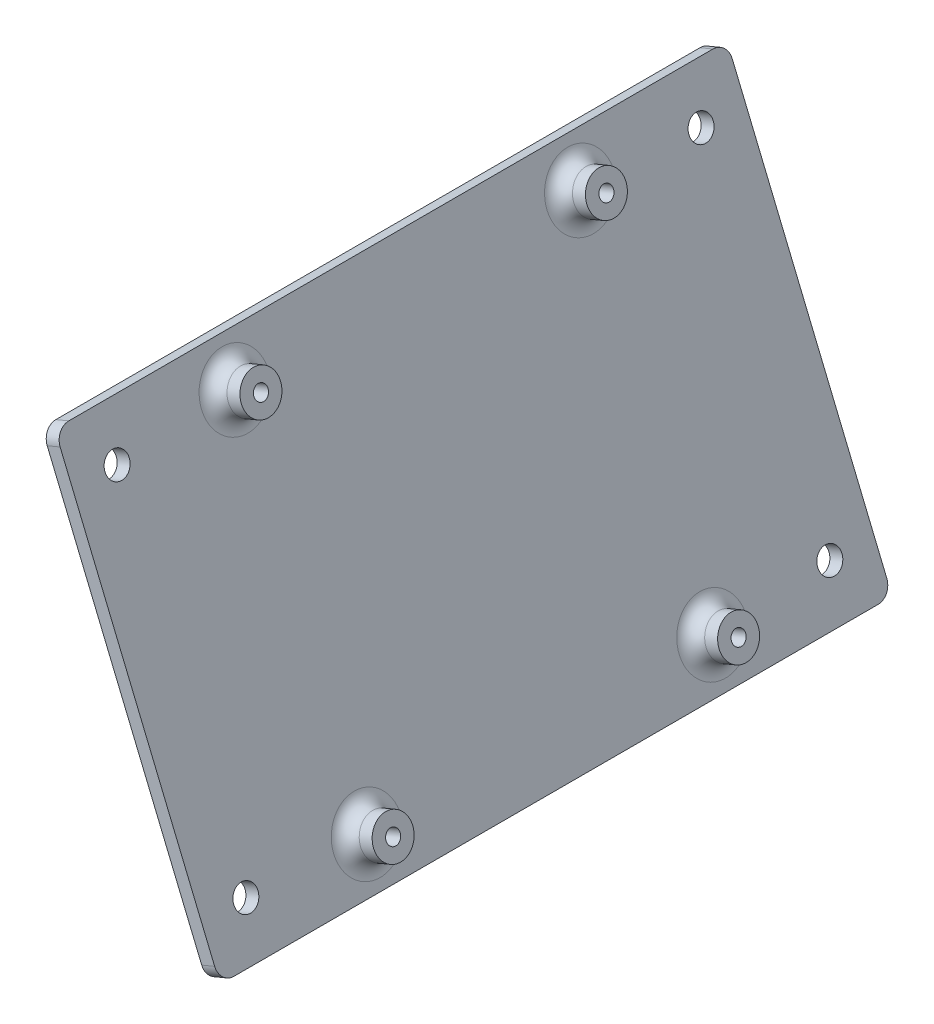
ISO-10303-21;
HEADER;
FILE_DESCRIPTION(('STEP AP214'),'2;1');
FILE_NAME('part.step','',(''),(''),'','','');
FILE_SCHEMA(('AUTOMOTIVE_DESIGN { 1 0 10303 214 1 1 1 1 }'));
ENDSEC;
DATA;
#1=APPLICATION_CONTEXT('core data for automotive mechanical design processes');
#2=APPLICATION_PROTOCOL_DEFINITION('international standard','automotive_design',2000,#1);
#3=PRODUCT_CONTEXT('',#1,'mechanical');
#4=PRODUCT('Part','Part','',(#3));
#5=PRODUCT_RELATED_PRODUCT_CATEGORY('part','',(#4));
#6=PRODUCT_DEFINITION_FORMATION('','',#4);
#7=PRODUCT_DEFINITION_CONTEXT('part definition',#1,'design');
#8=PRODUCT_DEFINITION('design','',#6,#7);
#9=PRODUCT_DEFINITION_SHAPE('','',#8);
#10=(LENGTH_UNIT() NAMED_UNIT(*) SI_UNIT(.MILLI.,.METRE.));
#11=(NAMED_UNIT(*) PLANE_ANGLE_UNIT() SI_UNIT($,.RADIAN.));
#12=(NAMED_UNIT(*) SI_UNIT($,.STERADIAN.) SOLID_ANGLE_UNIT());
#13=UNCERTAINTY_MEASURE_WITH_UNIT(LENGTH_MEASURE(1.E-05),#10,'distance_accuracy_value','');
#14=(GEOMETRIC_REPRESENTATION_CONTEXT(3) GLOBAL_UNCERTAINTY_ASSIGNED_CONTEXT((#13)) GLOBAL_UNIT_ASSIGNED_CONTEXT((#10,
#11,#12)) REPRESENTATION_CONTEXT('',''));
#15=CARTESIAN_POINT('',(0.,0.,0.));
#16=DIRECTION('',(0.,0.,1.));
#17=DIRECTION('',(1.,0.,0.));
#18=AXIS2_PLACEMENT_3D('',#15,#16,#17);
#19=CARTESIAN_POINT('',(-3730.4239511953,-1864.54989755948,-73.6875628277094));
#20=DIRECTION('',(0.,0.,1.));
#21=DIRECTION('',(1.,0.,0.));
#22=AXIS2_PLACEMENT_3D('',#19,#20,#21);
#23=PLANE('',#22);
#24=DIRECTION('',(-0.383049008063243,0.923728021347066,0.));
#25=VECTOR('',#24,1.);
#26=CARTESIAN_POINT('',(-3733.35678766308,-1865.76607816008,-73.6875628277094));
#27=LINE('',#26,#25);
#28=CARTESIAN_POINT('',(-3734.57296826368,-1862.83324169231,-73.6875628277094));
#29=VERTEX_POINT('',#28);
#30=CARTESIAN_POINT('',(-3769.59896956098,-1778.36755142033,-73.6875628277094));
#31=VERTEX_POINT('',#30);
#32=EDGE_CURVE('E140',#29,#31,#27,.T.);
#33=ORIENTED_EDGE('',*,*,#32,.T.);
#34=DIRECTION('',(-0.923728021347066,-0.383049008063243,0.));
#35=VECTOR('',#34,1.);
#36=CARTESIAN_POINT('',(-3766.6661330932,-1777.15137081973,-73.6875628277094));
#37=LINE('',#36,#35);
#38=CARTESIAN_POINT('',(-3766.6661330932,-1777.15137081973,-73.6875628277094));
#39=VERTEX_POINT('',#38);
#40=EDGE_CURVE('E117',#31,#39,#37,.F.);
#41=ORIENTED_EDGE('',*,*,#40,.T.);
#42=DIRECTION('',(-0.383049008063243,0.923728021347066,0.));
#43=VECTOR('',#42,1.);
#44=CARTESIAN_POINT('',(-3730.4239511953,-1864.54989755948,-73.6875628277094));
#45=LINE('',#44,#43);
#46=CARTESIAN_POINT('',(-3731.6401317959,-1861.6170610917,-73.6875628277094));
#47=VERTEX_POINT('',#46);
#48=EDGE_CURVE('E151',#47,#39,#45,.T.);
#49=ORIENTED_EDGE('',*,*,#48,.F.);
#50=DIRECTION('',(-0.923728021347066,-0.383049008063243,0.));
#51=VECTOR('',#50,1.);
#52=CARTESIAN_POINT('',(-3731.6401317959,-1861.6170610917,-73.6875628277094));
#53=LINE('',#52,#51);
#54=EDGE_CURVE('E122',#47,#29,#53,.T.);
#55=ORIENTED_EDGE('',*,*,#54,.T.);
#56=EDGE_LOOP('',(#33,#41,#49,#55));
#57=FACE_BOUND('',#56,.T.);
#58=ADVANCED_FACE('F41',(#57),#23,.F.);
#59=CARTESIAN_POINT('',(-3767.8823136938,-1774.21853435195,-73.6875628277094));
#60=DIRECTION('',(0.383049008063243,-0.923728021347066,0.));
#61=DIRECTION('',(0.923728021347066,0.383049008063243,0.));
#62=AXIS2_PLACEMENT_3D('',#59,#60,#61);
#63=PLANE('',#62);
#64=DIRECTION('',(0.,0.,1.));
#65=VECTOR('',#64,1.);
#66=CARTESIAN_POINT('',(-3767.8823136938,-1774.21853435195,-73.6875628277094));
#67=LINE('',#66,#65);
#68=CARTESIAN_POINT('',(-3767.8823136938,-1774.21853435195,-70.5125628277094));
#69=VERTEX_POINT('',#68);
#70=CARTESIAN_POINT('',(-3767.8823136938,-1774.21853435195,75.5374371722906));
#71=VERTEX_POINT('',#70);
#72=EDGE_CURVE('E132',#69,#71,#67,.T.);
#73=ORIENTED_EDGE('',*,*,#72,.F.);
#74=DIRECTION('',(-0.923728021347066,-0.383049008063243,0.));
#75=VECTOR('',#74,1.);
#76=CARTESIAN_POINT('',(-3767.8823136938,-1774.21853435195,-70.5125628277094));
#77=LINE('',#76,#75);
#78=CARTESIAN_POINT('',(-3770.81515016158,-1775.43471495255,-70.5125628277094));
#79=VERTEX_POINT('',#78);
#80=EDGE_CURVE('E116',#69,#79,#77,.T.);
#81=ORIENTED_EDGE('',*,*,#80,.T.);
#82=DIRECTION('',(0.,0.,1.));
#83=VECTOR('',#82,1.);
#84=CARTESIAN_POINT('',(-3770.81515016158,-1775.43471495255,-73.6875628277094));
#85=LINE('',#84,#83);
#86=CARTESIAN_POINT('',(-3770.81515016158,-1775.43471495255,75.5374371722906));
#87=VERTEX_POINT('',#86);
#88=EDGE_CURVE('E129',#79,#87,#85,.T.);
#89=ORIENTED_EDGE('',*,*,#88,.T.);
#90=DIRECTION('',(-0.923728021347066,-0.383049008063243,0.));
#91=VECTOR('',#90,1.);
#92=CARTESIAN_POINT('',(-3767.8823136938,-1774.21853435195,75.5374371722906));
#93=LINE('',#92,#91);
#94=EDGE_CURVE('E134',#87,#71,#93,.F.);
#95=ORIENTED_EDGE('',*,*,#94,.T.);
#96=EDGE_LOOP('',(#73,#81,#89,#95));
#97=FACE_BOUND('',#96,.T.);
#98=ADVANCED_FACE('F128',(#97),#63,.F.);
#99=CARTESIAN_POINT('',(-3730.4239511953,-1864.54989755948,78.7124371722906));
#100=DIRECTION('',(0.,0.,-1.));
#101=DIRECTION('',(-1.,0.,0.));
#102=AXIS2_PLACEMENT_3D('',#99,#100,#101);
#103=PLANE('',#102);
#104=DIRECTION('',(0.383049008063243,-0.923728021347066,0.));
#105=VECTOR('',#104,1.);
#106=CARTESIAN_POINT('',(-3730.4239511953,-1864.54989755948,78.7124371722906));
#107=LINE('',#106,#105);
#108=CARTESIAN_POINT('',(-3766.6661330932,-1777.15137081973,78.7124371722906));
#109=VERTEX_POINT('',#108);
#110=CARTESIAN_POINT('',(-3731.6401317959,-1861.6170610917,78.7124371722906));
#111=VERTEX_POINT('',#110);
#112=EDGE_CURVE('E256',#109,#111,#107,.T.);
#113=ORIENTED_EDGE('',*,*,#112,.F.);
#114=DIRECTION('',(-0.923728021347066,-0.383049008063243,0.));
#115=VECTOR('',#114,1.);
#116=CARTESIAN_POINT('',(-3766.6661330932,-1777.15137081973,78.7124371722906));
#117=LINE('',#116,#115);
#118=CARTESIAN_POINT('',(-3769.59896956098,-1778.36755142033,78.7124371722906));
#119=VERTEX_POINT('',#118);
#120=EDGE_CURVE('E11',#109,#119,#117,.T.);
#121=ORIENTED_EDGE('',*,*,#120,.T.);
#122=DIRECTION('',(0.383049008063243,-0.923728021347066,0.));
#123=VECTOR('',#122,1.);
#124=CARTESIAN_POINT('',(-3733.35678766308,-1865.76607816008,78.7124371722906));
#125=LINE('',#124,#123);
#126=CARTESIAN_POINT('',(-3734.57296826368,-1862.83324169231,78.7124371722906));
#127=VERTEX_POINT('',#126);
#128=EDGE_CURVE('E139',#119,#127,#125,.T.);
#129=ORIENTED_EDGE('',*,*,#128,.T.);
#130=DIRECTION('',(-0.923728021347066,-0.383049008063243,0.));
#131=VECTOR('',#130,1.);
#132=CARTESIAN_POINT('',(-3731.6401317959,-1861.6170610917,78.7124371722906));
#133=LINE('',#132,#131);
#134=EDGE_CURVE('E50',#127,#111,#133,.F.);
#135=ORIENTED_EDGE('',*,*,#134,.T.);
#136=EDGE_LOOP('',(#113,#121,#129,#135));
#137=FACE_BOUND('',#136,.T.);
#138=ADVANCED_FACE('F273',(#137),#103,.F.);
#139=CARTESIAN_POINT('',(-3730.4239511953,-1864.54989755948,-73.6875628277094));
#140=DIRECTION('',(-0.383049008063243,0.923728021347066,0.));
#141=DIRECTION('',(-0.923728021347066,-0.383049008063243,0.));
#142=AXIS2_PLACEMENT_3D('',#139,#140,#141);
#143=PLANE('',#142);
#144=DIRECTION('',(0.,0.,-1.));
#145=VECTOR('',#144,1.);
#146=CARTESIAN_POINT('',(-3733.35678766308,-1865.76607816008,-73.6875628277094));
#147=LINE('',#146,#145);
#148=CARTESIAN_POINT('',(-3733.35678766308,-1865.76607816008,75.5374371722906));
#149=VERTEX_POINT('',#148);
#150=CARTESIAN_POINT('',(-3733.35678766308,-1865.76607816008,-70.5125628277094));
#151=VERTEX_POINT('',#150);
#152=EDGE_CURVE('E143',#149,#151,#147,.T.);
#153=ORIENTED_EDGE('',*,*,#152,.T.);
#154=DIRECTION('',(-0.923728021347066,-0.383049008063243,0.));
#155=VECTOR('',#154,1.);
#156=CARTESIAN_POINT('',(-3730.4239511953,-1864.54989755948,-70.5125628277094));
#157=LINE('',#156,#155);
#158=CARTESIAN_POINT('',(-3730.4239511953,-1864.54989755948,-70.5125628277094));
#159=VERTEX_POINT('',#158);
#160=EDGE_CURVE('E60',#151,#159,#157,.F.);
#161=ORIENTED_EDGE('',*,*,#160,.T.);
#162=DIRECTION('',(0.,0.,-1.));
#163=VECTOR('',#162,1.);
#164=CARTESIAN_POINT('',(-3730.4239511953,-1864.54989755948,-73.6875628277094));
#165=LINE('',#164,#163);
#166=CARTESIAN_POINT('',(-3730.4239511953,-1864.54989755948,75.5374371722906));
#167=VERTEX_POINT('',#166);
#168=EDGE_CURVE('E156',#167,#159,#165,.T.);
#169=ORIENTED_EDGE('',*,*,#168,.F.);
#170=DIRECTION('',(-0.923728021347066,-0.383049008063243,0.));
#171=VECTOR('',#170,1.);
#172=CARTESIAN_POINT('',(-3730.4239511953,-1864.54989755948,75.5374371722906));
#173=LINE('',#172,#171);
#174=EDGE_CURVE('E195',#167,#149,#173,.T.);
#175=ORIENTED_EDGE('',*,*,#174,.T.);
#176=EDGE_LOOP('',(#153,#161,#169,#175));
#177=FACE_BOUND('',#176,.T.);
#178=ADVANCED_FACE('F268',(#177),#143,.F.);
#179=CARTESIAN_POINT('',(-3842.8112171268,-1593.52643946878,0.));
#180=DIRECTION('',(0.923728021347066,0.383049008063243,0.));
#181=DIRECTION('',(-0.383049008063243,0.923728021347066,0.));
#182=AXIS2_PLACEMENT_3D('',#179,#180,#181);
#183=PLANE('',#182);
#184=CARTESIAN_POINT('',(-3734.55896523735,-1854.57825356904,68.7124371722905));
#185=DIRECTION('',(0.923728021347066,0.383049008063243,0.));
#186=DIRECTION('',(-0.383049008063243,0.923728021347066,0.));
#187=AXIS2_PLACEMENT_3D('',#184,#185,#186);
#188=CIRCLE('',#187,2.75);
#189=CARTESIAN_POINT('',(-3735.61235000952,-1852.03800151034,68.7124371722905));
#190=VERTEX_POINT('',#189);
#191=EDGE_CURVE('E619',#190,#190,#188,.T.);
#192=ORIENTED_EDGE('',*,*,#191,.F.);
#193=EDGE_LOOP('',(#192));
#194=FACE_BOUND('',#193,.T.);
#195=CARTESIAN_POINT('',(-3763.74729965176,-1784.1901783424,68.7124371722905));
#196=DIRECTION('',(0.923728021347066,0.383049008063243,0.));
#197=DIRECTION('',(-0.383049008063243,0.923728021347066,0.));
#198=AXIS2_PLACEMENT_3D('',#195,#196,#197);
#199=CIRCLE('',#198,2.75000000000007);
#200=CARTESIAN_POINT('',(-3764.80068442394,-1781.64992628369,68.7124371722905));
#201=VERTEX_POINT('',#200);
#202=EDGE_CURVE('E620',#201,#201,#199,.T.);
#203=ORIENTED_EDGE('',*,*,#202,.F.);
#204=EDGE_LOOP('',(#203));
#205=FACE_BOUND('',#204,.T.);
#206=CARTESIAN_POINT('',(-3763.74729965176,-1784.1901783424,-63.6875628277093));
#207=DIRECTION('',(0.923728021347066,0.383049008063243,0.));
#208=DIRECTION('',(-0.383049008063243,0.923728021347066,0.));
#209=AXIS2_PLACEMENT_3D('',#206,#207,#208);
#210=CIRCLE('',#209,2.75);
#211=CARTESIAN_POINT('',(-3764.80068442394,-1781.64992628369,-63.6875628277093));
#212=VERTEX_POINT('',#211);
#213=EDGE_CURVE('E623',#212,#212,#210,.T.);
#214=ORIENTED_EDGE('',*,*,#213,.F.);
#215=EDGE_LOOP('',(#214));
#216=FACE_BOUND('',#215,.T.);
#217=CARTESIAN_POINT('',(-3734.55896523735,-1854.57825356904,-63.6875628277093));
#218=DIRECTION('',(0.923728021347066,0.383049008063243,0.));
#219=DIRECTION('',(-0.383049008063243,0.923728021347066,0.));
#220=AXIS2_PLACEMENT_3D('',#217,#218,#219);
#221=CIRCLE('',#220,2.75);
#222=CARTESIAN_POINT('',(-3735.61235000952,-1852.03800151034,-63.6875628277093));
#223=VERTEX_POINT('',#222);
#224=EDGE_CURVE('E206',#223,#223,#221,.T.);
#225=ORIENTED_EDGE('',*,*,#224,.F.);
#226=EDGE_LOOP('',(#225));
#227=FACE_BOUND('',#226,.T.);
#228=CARTESIAN_POINT('',(-3734.16825524912,-1855.52045615081,41.5774371722916));
#229=DIRECTION('',(0.923728021347066,0.383049008063243,0.));
#230=DIRECTION('',(-0.383049008063243,0.923728021347066,0.));
#231=AXIS2_PLACEMENT_3D('',#228,#229,#230);
#232=CIRCLE('',#231,7.61999999999901);
#233=CARTESIAN_POINT('',(-3737.08708869056,-1848.48164862815,41.5774371722916));
#234=VERTEX_POINT('',#233);
#235=EDGE_CURVE('E166',#234,#234,#232,.F.);
#236=ORIENTED_EDGE('',*,*,#235,.T.);
#237=EDGE_LOOP('',(#236));
#238=FACE_BOUND('',#237,.T.);
#239=CARTESIAN_POINT('',(-3764.13800963999,-1783.24797576062,41.5774371722916));
#240=DIRECTION('',(0.923728021347066,0.383049008063243,0.));
#241=DIRECTION('',(-0.383049008063243,0.923728021347066,0.));
#242=AXIS2_PLACEMENT_3D('',#239,#240,#241);
#243=CIRCLE('',#242,7.61999999999908);
#244=CARTESIAN_POINT('',(-3767.05684308143,-1776.20916823796,41.5774371722916));
#245=VERTEX_POINT('',#244);
#246=EDGE_CURVE('E163',#245,#245,#243,.F.);
#247=ORIENTED_EDGE('',*,*,#246,.T.);
#248=EDGE_LOOP('',(#247));
#249=FACE_BOUND('',#248,.T.);
#250=CARTESIAN_POINT('',(-3764.13800963999,-1783.24797576062,-36.7525628277084));
#251=DIRECTION('',(0.923728021347066,0.383049008063243,0.));
#252=DIRECTION('',(-0.383049008063243,0.923728021347066,0.));
#253=AXIS2_PLACEMENT_3D('',#250,#251,#252);
#254=CIRCLE('',#253,7.61999999999911);
#255=CARTESIAN_POINT('',(-3767.05684308143,-1776.20916823796,-36.7525628277084));
#256=VERTEX_POINT('',#255);
#257=EDGE_CURVE('E160',#256,#256,#254,.F.);
#258=ORIENTED_EDGE('',*,*,#257,.T.);
#259=EDGE_LOOP('',(#258));
#260=FACE_BOUND('',#259,.T.);
#261=CARTESIAN_POINT('',(-3734.16825524912,-1855.52045615081,-36.7525628277084));
#262=DIRECTION('',(0.923728021347066,0.383049008063243,0.));
#263=DIRECTION('',(-0.383049008063243,0.923728021347066,0.));
#264=AXIS2_PLACEMENT_3D('',#261,#262,#263);
#265=CIRCLE('',#264,7.61999999999901);
#266=CARTESIAN_POINT('',(-3737.08708869056,-1848.48164862815,-36.7525628277084));
#267=VERTEX_POINT('',#266);
#268=EDGE_CURVE('E155',#267,#267,#265,.F.);
#269=ORIENTED_EDGE('',*,*,#268,.T.);
#270=EDGE_LOOP('',(#269));
#271=FACE_BOUND('',#270,.T.);
#272=ORIENTED_EDGE('',*,*,#48,.T.);
#273=CARTESIAN_POINT('',(-3766.6661330932,-1777.15137081973,-70.5125628277094));
#274=DIRECTION('',(0.923728021347066,0.383049008063243,0.));
#275=DIRECTION('',(-0.383049008063243,0.923728021347066,0.));
#276=AXIS2_PLACEMENT_3D('',#273,#274,#275);
#277=CIRCLE('',#276,3.175);
#278=EDGE_CURVE('E193',#39,#69,#277,.T.);
#279=ORIENTED_EDGE('',*,*,#278,.T.);
#280=ORIENTED_EDGE('',*,*,#72,.T.);
#281=CARTESIAN_POINT('',(-3766.6661330932,-1777.15137081973,75.5374371722907));
#282=DIRECTION('',(0.923728021347066,0.383049008063243,0.));
#283=DIRECTION('',(-0.383049008063243,0.923728021347066,0.));
#284=AXIS2_PLACEMENT_3D('',#281,#282,#283);
#285=CIRCLE('',#284,3.175);
#286=EDGE_CURVE('E188',#71,#109,#285,.T.);
#287=ORIENTED_EDGE('',*,*,#286,.T.);
#288=ORIENTED_EDGE('',*,*,#112,.T.);
#289=CARTESIAN_POINT('',(-3731.6401317959,-1861.61706109171,75.5374371722906));
#290=DIRECTION('',(0.923728021347066,0.383049008063243,0.));
#291=DIRECTION('',(-0.383049008063243,0.923728021347066,0.));
#292=AXIS2_PLACEMENT_3D('',#289,#290,#291);
#293=CIRCLE('',#292,3.175);
#294=EDGE_CURVE('E67',#111,#167,#293,.T.);
#295=ORIENTED_EDGE('',*,*,#294,.T.);
#296=ORIENTED_EDGE('',*,*,#168,.T.);
#297=CARTESIAN_POINT('',(-3731.6401317959,-1861.61706109171,-70.5125628277094));
#298=DIRECTION('',(0.923728021347066,0.383049008063243,0.));
#299=DIRECTION('',(-0.383049008063243,0.923728021347066,0.));
#300=AXIS2_PLACEMENT_3D('',#297,#298,#299);
#301=CIRCLE('',#300,3.175);
#302=EDGE_CURVE('E190',#159,#47,#301,.T.);
#303=ORIENTED_EDGE('',*,*,#302,.T.);
#304=EDGE_LOOP('',(#272,#279,#280,#287,#288,#295,#296,#303));
#305=FACE_BOUND('',#304,.T.);
#306=ADVANCED_FACE('F260',(#194,#205,#216,#227,#238,#249,#260,#271,#305),#183,.T.);
#307=CARTESIAN_POINT('',(-3845.74405359458,-1594.74262006938,0.));
#308=DIRECTION('',(0.923728021347066,0.383049008063243,0.));
#309=DIRECTION('',(-0.383049008063243,0.923728021347066,0.));
#310=AXIS2_PLACEMENT_3D('',#307,#308,#309);
#311=PLANE('',#310);
#312=CARTESIAN_POINT('',(-3737.49180170512,-1855.79443416964,68.7124371722905));
#313=DIRECTION('',(0.923728021347066,0.383049008063243,0.));
#314=DIRECTION('',(-0.383049008063243,0.923728021347066,0.));
#315=AXIS2_PLACEMENT_3D('',#312,#313,#314);
#316=CIRCLE('',#315,2.75);
#317=CARTESIAN_POINT('',(-3738.54518647729,-1853.25418211094,68.7124371722905));
#318=VERTEX_POINT('',#317);
#319=EDGE_CURVE('E45',#318,#318,#316,.T.);
#320=ORIENTED_EDGE('',*,*,#319,.T.);
#321=EDGE_LOOP('',(#320));
#322=FACE_BOUND('',#321,.T.);
#323=CARTESIAN_POINT('',(-3766.68013611954,-1785.40635894299,68.7124371722905));
#324=DIRECTION('',(0.923728021347066,0.383049008063243,0.));
#325=DIRECTION('',(-0.383049008063243,0.923728021347066,0.));
#326=AXIS2_PLACEMENT_3D('',#323,#324,#325);
#327=CIRCLE('',#326,2.75000000000007);
#328=CARTESIAN_POINT('',(-3767.73352089171,-1782.86610688429,68.7124371722905));
#329=VERTEX_POINT('',#328);
#330=EDGE_CURVE('E208',#329,#329,#327,.T.);
#331=ORIENTED_EDGE('',*,*,#330,.T.);
#332=EDGE_LOOP('',(#331));
#333=FACE_BOUND('',#332,.T.);
#334=CARTESIAN_POINT('',(-3766.68013611954,-1785.40635894299,-63.6875628277093));
#335=DIRECTION('',(0.923728021347066,0.383049008063243,0.));
#336=DIRECTION('',(-0.383049008063243,0.923728021347066,0.));
#337=AXIS2_PLACEMENT_3D('',#334,#335,#336);
#338=CIRCLE('',#337,2.75);
#339=CARTESIAN_POINT('',(-3767.73352089171,-1782.86610688429,-63.6875628277093));
#340=VERTEX_POINT('',#339);
#341=EDGE_CURVE('E205',#340,#340,#338,.T.);
#342=ORIENTED_EDGE('',*,*,#341,.T.);
#343=EDGE_LOOP('',(#342));
#344=FACE_BOUND('',#343,.T.);
#345=CARTESIAN_POINT('',(-3737.49180170512,-1855.79443416964,-63.6875628277093));
#346=DIRECTION('',(0.923728021347066,0.383049008063243,0.));
#347=DIRECTION('',(-0.383049008063243,0.923728021347066,0.));
#348=AXIS2_PLACEMENT_3D('',#345,#346,#347);
#349=CIRCLE('',#348,2.75);
#350=CARTESIAN_POINT('',(-3738.54518647729,-1853.25418211094,-63.6875628277093));
#351=VERTEX_POINT('',#350);
#352=EDGE_CURVE('E201',#351,#351,#349,.T.);
#353=ORIENTED_EDGE('',*,*,#352,.T.);
#354=EDGE_LOOP('',(#353));
#355=FACE_BOUND('',#354,.T.);
#356=CARTESIAN_POINT('',(-3737.1010917169,-1856.73663675142,-36.7525628277087));
#357=DIRECTION('',(0.923728021347066,0.383049008063243,0.));
#358=DIRECTION('',(-0.383049008063243,0.923728021347066,0.));
#359=AXIS2_PLACEMENT_3D('',#356,#357,#358);
#360=CIRCLE('',#359,1.59999999999818);
#361=CARTESIAN_POINT('',(-3737.7139701298,-1855.25867191726,-36.7525628277087));
#362=VERTEX_POINT('',#361);
#363=EDGE_CURVE('E238',#362,#362,#360,.T.);
#364=ORIENTED_EDGE('',*,*,#363,.T.);
#365=EDGE_LOOP('',(#364));
#366=FACE_BOUND('',#365,.T.);
#367=CARTESIAN_POINT('',(-3737.1010917169,-1856.73663675142,41.5774371722913));
#368=DIRECTION('',(0.923728021347066,0.383049008063243,0.));
#369=DIRECTION('',(-0.383049008063243,0.923728021347066,0.));
#370=AXIS2_PLACEMENT_3D('',#367,#368,#369);
#371=CIRCLE('',#370,1.59999999999817);
#372=CARTESIAN_POINT('',(-3737.7139701298,-1855.25867191726,41.5774371722913));
#373=VERTEX_POINT('',#372);
#374=EDGE_CURVE('E235',#373,#373,#371,.T.);
#375=ORIENTED_EDGE('',*,*,#374,.T.);
#376=EDGE_LOOP('',(#375));
#377=FACE_BOUND('',#376,.T.);
#378=CARTESIAN_POINT('',(-3767.07084610776,-1784.46415636122,41.5774371722913));
#379=DIRECTION('',(0.923728021347066,0.383049008063243,0.));
#380=DIRECTION('',(-0.383049008063243,0.923728021347066,0.));
#381=AXIS2_PLACEMENT_3D('',#378,#379,#380);
#382=CIRCLE('',#381,1.59999999999822);
#383=CARTESIAN_POINT('',(-3767.68372452066,-1782.98619152707,41.5774371722913));
#384=VERTEX_POINT('',#383);
#385=EDGE_CURVE('E232',#384,#384,#382,.T.);
#386=ORIENTED_EDGE('',*,*,#385,.T.);
#387=EDGE_LOOP('',(#386));
#388=FACE_BOUND('',#387,.T.);
#389=CARTESIAN_POINT('',(-3767.07084610776,-1784.46415636122,-36.7525628277087));
#390=DIRECTION('',(0.923728021347066,0.383049008063243,0.));
#391=DIRECTION('',(-0.383049008063243,0.923728021347066,0.));
#392=AXIS2_PLACEMENT_3D('',#389,#390,#391);
#393=CIRCLE('',#392,1.59999999999823);
#394=CARTESIAN_POINT('',(-3767.68372452066,-1782.98619152707,-36.7525628277087));
#395=VERTEX_POINT('',#394);
#396=EDGE_CURVE('E229',#395,#395,#393,.T.);
#397=ORIENTED_EDGE('',*,*,#396,.T.);
#398=EDGE_LOOP('',(#397));
#399=FACE_BOUND('',#398,.T.);
#400=ORIENTED_EDGE('',*,*,#88,.F.);
#401=CARTESIAN_POINT('',(-3769.59896956098,-1778.36755142033,-70.5125628277094));
#402=DIRECTION('',(0.923728021347066,0.383049008063243,0.));
#403=DIRECTION('',(-0.383049008063243,0.923728021347066,0.));
#404=AXIS2_PLACEMENT_3D('',#401,#402,#403);
#405=CIRCLE('',#404,3.175);
#406=EDGE_CURVE('E112',#79,#31,#405,.F.);
#407=ORIENTED_EDGE('',*,*,#406,.T.);
#408=ORIENTED_EDGE('',*,*,#32,.F.);
#409=CARTESIAN_POINT('',(-3734.57296826368,-1862.83324169231,-70.5125628277094));
#410=DIRECTION('',(0.923728021347066,0.383049008063243,0.));
#411=DIRECTION('',(-0.383049008063243,0.923728021347066,0.));
#412=AXIS2_PLACEMENT_3D('',#409,#410,#411);
#413=CIRCLE('',#412,3.175);
#414=EDGE_CURVE('E123',#29,#151,#413,.F.);
#415=ORIENTED_EDGE('',*,*,#414,.T.);
#416=ORIENTED_EDGE('',*,*,#152,.F.);
#417=CARTESIAN_POINT('',(-3734.57296826368,-1862.83324169231,75.5374371722906));
#418=DIRECTION('',(0.923728021347066,0.383049008063243,0.));
#419=DIRECTION('',(-0.383049008063243,0.923728021347066,0.));
#420=AXIS2_PLACEMENT_3D('',#417,#418,#419);
#421=CIRCLE('',#420,3.175);
#422=EDGE_CURVE('E133',#149,#127,#421,.F.);
#423=ORIENTED_EDGE('',*,*,#422,.T.);
#424=ORIENTED_EDGE('',*,*,#128,.F.);
#425=CARTESIAN_POINT('',(-3769.59896956098,-1778.36755142033,75.5374371722907));
#426=DIRECTION('',(0.923728021347066,0.383049008063243,0.));
#427=DIRECTION('',(-0.383049008063243,0.923728021347066,0.));
#428=AXIS2_PLACEMENT_3D('',#425,#426,#427);
#429=CIRCLE('',#428,3.175);
#430=EDGE_CURVE('E138',#119,#87,#429,.F.);
#431=ORIENTED_EDGE('',*,*,#430,.T.);
#432=EDGE_LOOP('',(#400,#407,#408,#415,#416,#423,#424,#431));
#433=FACE_BOUND('',#432,.T.);
#434=ADVANCED_FACE('F136',(#322,#333,#344,#355,#366,#377,#388,#399,#433),#311,.F.);
#435=CARTESIAN_POINT('',(-3728.30258231356,-1853.08809494961,-36.7525628277084));
#436=DIRECTION('',(-0.923728021347066,-0.383049008063244,0.));
#437=DIRECTION('',(0.383049008063244,-0.923728021347066,0.));
#438=AXIS2_PLACEMENT_3D('',#435,#436,#437);
#439=CYLINDRICAL_SURFACE('',#438,4.44499999999901);
#440=CARTESIAN_POINT('',(-3731.23541878134,-1854.30427555021,-36.7525628277084));
#441=DIRECTION('',(0.923728021347066,0.383049008063243,0.));
#442=DIRECTION('',(-0.383049008063243,0.923728021347066,0.));
#443=AXIS2_PLACEMENT_3D('',#440,#441,#442);
#444=CIRCLE('',#443,4.44499999999901);
#445=CARTESIAN_POINT('',(-3732.93807162218,-1850.19830449533,-36.7525628277084));
#446=VERTEX_POINT('',#445);
#447=EDGE_CURVE('E175',#446,#446,#444,.T.);
#448=ORIENTED_EDGE('',*,*,#447,.T.);
#449=EDGE_LOOP('',(#448));
#450=FACE_BOUND('',#449,.T.);
#451=CARTESIAN_POINT('',(-3728.30258231356,-1853.08809494961,-36.7525628277084));
#452=DIRECTION('',(0.923728021347066,0.383049008063244,0.));
#453=DIRECTION('',(-0.383049008063244,0.923728021347066,0.));
#454=AXIS2_PLACEMENT_3D('',#451,#452,#453);
#455=CIRCLE('',#454,4.44499999999901);
#456=CARTESIAN_POINT('',(-3730.00523515441,-1848.98212389473,-36.7525628277084));
#457=VERTEX_POINT('',#456);
#458=EDGE_CURVE('E145',#457,#457,#455,.T.);
#459=ORIENTED_EDGE('',*,*,#458,.F.);
#460=EDGE_LOOP('',(#459));
#461=FACE_BOUND('',#460,.T.);
#462=ADVANCED_FACE('F356',(#450,#461),#439,.T.);
#463=CARTESIAN_POINT('',(-3728.30258231356,-1853.08809494961,-36.7525628277084));
#464=DIRECTION('',(0.923728021347066,0.383049008063244,0.));
#465=DIRECTION('',(-0.383049008063244,0.923728021347066,0.));
#466=AXIS2_PLACEMENT_3D('',#463,#464,#465);
#467=PLANE('',#466);
#468=CARTESIAN_POINT('',(-3728.30258231356,-1853.08809494961,-36.7525628277087));
#469=DIRECTION('',(0.923728021347066,0.383049008063244,0.));
#470=DIRECTION('',(-0.383049008063244,0.923728021347066,0.));
#471=AXIS2_PLACEMENT_3D('',#468,#469,#470);
#472=CIRCLE('',#471,1.59999999999818);
#473=CARTESIAN_POINT('',(-3728.91546072646,-1851.61013011546,-36.7525628277087));
#474=VERTEX_POINT('',#473);
#475=EDGE_CURVE('E213',#474,#474,#472,.T.);
#476=ORIENTED_EDGE('',*,*,#475,.F.);
#477=EDGE_LOOP('',(#476));
#478=FACE_BOUND('',#477,.T.);
#479=ORIENTED_EDGE('',*,*,#458,.T.);
#480=EDGE_LOOP('',(#479));
#481=FACE_BOUND('',#480,.T.);
#482=ADVANCED_FACE('F349',(#478,#481),#467,.T.);
#483=CARTESIAN_POINT('',(-3728.30258231356,-1853.08809494961,41.5774371722916));
#484=DIRECTION('',(-0.923728021347066,-0.383049008063244,0.));
#485=DIRECTION('',(0.383049008063244,-0.923728021347066,0.));
#486=AXIS2_PLACEMENT_3D('',#483,#484,#485);
#487=CYLINDRICAL_SURFACE('',#486,4.44499999999901);
#488=CARTESIAN_POINT('',(-3731.23541878134,-1854.30427555021,41.5774371722916));
#489=DIRECTION('',(0.923728021347066,0.383049008063243,0.));
#490=DIRECTION('',(-0.383049008063243,0.923728021347066,0.));
#491=AXIS2_PLACEMENT_3D('',#488,#489,#490);
#492=CIRCLE('',#491,4.44499999999901);
#493=CARTESIAN_POINT('',(-3732.93807162218,-1850.19830449533,41.5774371722916));
#494=VERTEX_POINT('',#493);
#495=EDGE_CURVE('E152',#494,#494,#492,.T.);
#496=ORIENTED_EDGE('',*,*,#495,.T.);
#497=EDGE_LOOP('',(#496));
#498=FACE_BOUND('',#497,.T.);
#499=CARTESIAN_POINT('',(-3728.30258231356,-1853.08809494961,41.5774371722916));
#500=DIRECTION('',(0.923728021347066,0.383049008063244,0.));
#501=DIRECTION('',(-0.383049008063244,0.923728021347066,0.));
#502=AXIS2_PLACEMENT_3D('',#499,#500,#501);
#503=CIRCLE('',#502,4.44499999999901);
#504=CARTESIAN_POINT('',(-3730.00523515441,-1848.98212389473,41.5774371722916));
#505=VERTEX_POINT('',#504);
#506=EDGE_CURVE('E247',#505,#505,#503,.T.);
#507=ORIENTED_EDGE('',*,*,#506,.F.);
#508=EDGE_LOOP('',(#507));
#509=FACE_BOUND('',#508,.T.);
#510=ADVANCED_FACE('F346',(#498,#509),#487,.T.);
#511=CARTESIAN_POINT('',(-3728.30258231356,-1853.08809494961,41.5774371722916));
#512=DIRECTION('',(0.923728021347066,0.383049008063244,0.));
#513=DIRECTION('',(-0.383049008063244,0.923728021347066,0.));
#514=AXIS2_PLACEMENT_3D('',#511,#512,#513);
#515=PLANE('',#514);
#516=CARTESIAN_POINT('',(-3728.30258231356,-1853.08809494961,41.5774371722913));
#517=DIRECTION('',(0.923728021347066,0.383049008063244,0.));
#518=DIRECTION('',(-0.383049008063244,0.923728021347066,0.));
#519=AXIS2_PLACEMENT_3D('',#516,#517,#518);
#520=CIRCLE('',#519,1.59999999999817);
#521=CARTESIAN_POINT('',(-3728.91546072646,-1851.61013011546,41.5774371722913));
#522=VERTEX_POINT('',#521);
#523=EDGE_CURVE('E217',#522,#522,#520,.T.);
#524=ORIENTED_EDGE('',*,*,#523,.F.);
#525=EDGE_LOOP('',(#524));
#526=FACE_BOUND('',#525,.T.);
#527=ORIENTED_EDGE('',*,*,#506,.T.);
#528=EDGE_LOOP('',(#527));
#529=FACE_BOUND('',#528,.T.);
#530=ADVANCED_FACE('F341',(#526,#529),#515,.T.);
#531=CARTESIAN_POINT('',(-3758.27233670443,-1780.81561455942,41.5774371722916));
#532=DIRECTION('',(-0.923728021347066,-0.383049008063244,0.));
#533=DIRECTION('',(0.383049008063244,-0.923728021347066,0.));
#534=AXIS2_PLACEMENT_3D('',#531,#532,#533);
#535=CYLINDRICAL_SURFACE('',#534,4.44499999999908);
#536=CARTESIAN_POINT('',(-3761.20517317221,-1782.03179516002,41.5774371722916));
#537=DIRECTION('',(0.923728021347066,0.383049008063243,0.));
#538=DIRECTION('',(-0.383049008063243,0.923728021347066,0.));
#539=AXIS2_PLACEMENT_3D('',#536,#537,#538);
#540=CIRCLE('',#539,4.44499999999908);
#541=CARTESIAN_POINT('',(-3762.90782601305,-1777.92582410513,41.5774371722916));
#542=VERTEX_POINT('',#541);
#543=EDGE_CURVE('E169',#542,#542,#540,.T.);
#544=ORIENTED_EDGE('',*,*,#543,.T.);
#545=EDGE_LOOP('',(#544));
#546=FACE_BOUND('',#545,.T.);
#547=CARTESIAN_POINT('',(-3758.27233670443,-1780.81561455942,41.5774371722916));
#548=DIRECTION('',(0.923728021347066,0.383049008063244,0.));
#549=DIRECTION('',(-0.383049008063244,0.923728021347066,0.));
#550=AXIS2_PLACEMENT_3D('',#547,#548,#549);
#551=CIRCLE('',#550,4.44499999999908);
#552=CARTESIAN_POINT('',(-3759.97498954527,-1776.70964350453,41.5774371722916));
#553=VERTEX_POINT('',#552);
#554=EDGE_CURVE('E244',#553,#553,#551,.T.);
#555=ORIENTED_EDGE('',*,*,#554,.F.);
#556=EDGE_LOOP('',(#555));
#557=FACE_BOUND('',#556,.T.);
#558=ADVANCED_FACE('F338',(#546,#557),#535,.T.);
#559=CARTESIAN_POINT('',(-3758.27233670443,-1780.81561455942,41.5774371722916));
#560=DIRECTION('',(0.923728021347066,0.383049008063244,0.));
#561=DIRECTION('',(-0.383049008063244,0.923728021347066,0.));
#562=AXIS2_PLACEMENT_3D('',#559,#560,#561);
#563=PLANE('',#562);
#564=CARTESIAN_POINT('',(-3758.27233670443,-1780.81561455942,41.5774371722913));
#565=DIRECTION('',(0.923728021347066,0.383049008063244,0.));
#566=DIRECTION('',(-0.383049008063244,0.923728021347066,0.));
#567=AXIS2_PLACEMENT_3D('',#564,#565,#566);
#568=CIRCLE('',#567,1.59999999999822);
#569=CARTESIAN_POINT('',(-3758.88521511733,-1779.33764972527,41.5774371722913));
#570=VERTEX_POINT('',#569);
#571=EDGE_CURVE('E222',#570,#570,#568,.T.);
#572=ORIENTED_EDGE('',*,*,#571,.F.);
#573=EDGE_LOOP('',(#572));
#574=FACE_BOUND('',#573,.T.);
#575=ORIENTED_EDGE('',*,*,#554,.T.);
#576=EDGE_LOOP('',(#575));
#577=FACE_BOUND('',#576,.T.);
#578=ADVANCED_FACE('F333',(#574,#577),#563,.T.);
#579=CARTESIAN_POINT('',(-3758.27233670443,-1780.81561455942,-36.7525628277084));
#580=DIRECTION('',(-0.923728021347066,-0.383049008063244,0.));
#581=DIRECTION('',(0.383049008063244,-0.923728021347066,0.));
#582=AXIS2_PLACEMENT_3D('',#579,#580,#581);
#583=CYLINDRICAL_SURFACE('',#582,4.44499999999911);
#584=CARTESIAN_POINT('',(-3761.20517317221,-1782.03179516002,-36.7525628277084));
#585=DIRECTION('',(0.923728021347066,0.383049008063243,0.));
#586=DIRECTION('',(-0.383049008063243,0.923728021347066,0.));
#587=AXIS2_PLACEMENT_3D('',#584,#585,#586);
#588=CIRCLE('',#587,4.44499999999911);
#589=CARTESIAN_POINT('',(-3762.90782601305,-1777.92582410513,-36.7525628277084));
#590=VERTEX_POINT('',#589);
#591=EDGE_CURVE('E172',#590,#590,#588,.T.);
#592=ORIENTED_EDGE('',*,*,#591,.T.);
#593=EDGE_LOOP('',(#592));
#594=FACE_BOUND('',#593,.T.);
#595=CARTESIAN_POINT('',(-3758.27233670443,-1780.81561455942,-36.7525628277084));
#596=DIRECTION('',(0.923728021347066,0.383049008063244,0.));
#597=DIRECTION('',(-0.383049008063244,0.923728021347066,0.));
#598=AXIS2_PLACEMENT_3D('',#595,#596,#597);
#599=CIRCLE('',#598,4.44499999999911);
#600=CARTESIAN_POINT('',(-3759.97498954527,-1776.70964350453,-36.7525628277084));
#601=VERTEX_POINT('',#600);
#602=EDGE_CURVE('E241',#601,#601,#599,.T.);
#603=ORIENTED_EDGE('',*,*,#602,.F.);
#604=EDGE_LOOP('',(#603));
#605=FACE_BOUND('',#604,.T.);
#606=ADVANCED_FACE('F330',(#594,#605),#583,.T.);
#607=CARTESIAN_POINT('',(-3758.27233670443,-1780.81561455942,-36.7525628277084));
#608=DIRECTION('',(0.923728021347066,0.383049008063244,0.));
#609=DIRECTION('',(-0.383049008063244,0.923728021347066,0.));
#610=AXIS2_PLACEMENT_3D('',#607,#608,#609);
#611=PLANE('',#610);
#612=CARTESIAN_POINT('',(-3758.27233670443,-1780.81561455942,-36.7525628277087));
#613=DIRECTION('',(0.923728021347066,0.383049008063244,0.));
#614=DIRECTION('',(-0.383049008063244,0.923728021347066,0.));
#615=AXIS2_PLACEMENT_3D('',#612,#613,#614);
#616=CIRCLE('',#615,1.59999999999823);
#617=CARTESIAN_POINT('',(-3758.88521511733,-1779.33764972527,-36.7525628277087));
#618=VERTEX_POINT('',#617);
#619=EDGE_CURVE('E226',#618,#618,#616,.T.);
#620=ORIENTED_EDGE('',*,*,#619,.F.);
#621=EDGE_LOOP('',(#620));
#622=FACE_BOUND('',#621,.T.);
#623=ORIENTED_EDGE('',*,*,#602,.T.);
#624=EDGE_LOOP('',(#623));
#625=FACE_BOUND('',#624,.T.);
#626=ADVANCED_FACE('F297',(#622,#625),#611,.T.);
#627=CARTESIAN_POINT('',(-3731.23541878134,-1854.30427555021,41.5774371722916));
#628=DIRECTION('',(0.923728021347066,0.383049008063243,0.));
#629=DIRECTION('',(-0.383049008063243,0.923728021347066,0.));
#630=AXIS2_PLACEMENT_3D('',#627,#628,#629);
#631=TOROIDAL_SURFACE('',#630,7.61999999999901,3.175);
#632=ORIENTED_EDGE('',*,*,#235,.F.);
#633=EDGE_LOOP('',(#632));
#634=FACE_BOUND('',#633,.T.);
#635=ORIENTED_EDGE('',*,*,#495,.F.);
#636=EDGE_LOOP('',(#635));
#637=FACE_BOUND('',#636,.T.);
#638=ADVANCED_FACE('F293',(#634,#637),#631,.F.);
#639=CARTESIAN_POINT('',(-3761.20517317221,-1782.03179516002,41.5774371722916));
#640=DIRECTION('',(0.923728021347066,0.383049008063243,0.));
#641=DIRECTION('',(-0.383049008063243,0.923728021347066,0.));
#642=AXIS2_PLACEMENT_3D('',#639,#640,#641);
#643=TOROIDAL_SURFACE('',#642,7.61999999999908,3.175);
#644=ORIENTED_EDGE('',*,*,#246,.F.);
#645=EDGE_LOOP('',(#644));
#646=FACE_BOUND('',#645,.T.);
#647=ORIENTED_EDGE('',*,*,#543,.F.);
#648=EDGE_LOOP('',(#647));
#649=FACE_BOUND('',#648,.T.);
#650=ADVANCED_FACE('F296',(#646,#649),#643,.F.);
#651=CARTESIAN_POINT('',(-3761.20517317221,-1782.03179516002,-36.7525628277084));
#652=DIRECTION('',(0.923728021347066,0.383049008063243,0.));
#653=DIRECTION('',(-0.383049008063243,0.923728021347066,0.));
#654=AXIS2_PLACEMENT_3D('',#651,#652,#653);
#655=TOROIDAL_SURFACE('',#654,7.61999999999911,3.175);
#656=ORIENTED_EDGE('',*,*,#257,.F.);
#657=EDGE_LOOP('',(#656));
#658=FACE_BOUND('',#657,.T.);
#659=ORIENTED_EDGE('',*,*,#591,.F.);
#660=EDGE_LOOP('',(#659));
#661=FACE_BOUND('',#660,.T.);
#662=ADVANCED_FACE('F301',(#658,#661),#655,.F.);
#663=CARTESIAN_POINT('',(-3731.23541878134,-1854.30427555021,-36.7525628277084));
#664=DIRECTION('',(0.923728021347066,0.383049008063243,0.));
#665=DIRECTION('',(-0.383049008063243,0.923728021347066,0.));
#666=AXIS2_PLACEMENT_3D('',#663,#664,#665);
#667=TOROIDAL_SURFACE('',#666,7.61999999999901,3.175);
#668=ORIENTED_EDGE('',*,*,#268,.F.);
#669=EDGE_LOOP('',(#668));
#670=FACE_BOUND('',#669,.T.);
#671=ORIENTED_EDGE('',*,*,#447,.F.);
#672=EDGE_LOOP('',(#671));
#673=FACE_BOUND('',#672,.T.);
#674=ADVANCED_FACE('F305',(#670,#673),#667,.F.);
#675=CARTESIAN_POINT('',(-3799.03307258622,-1797.71816497104,-36.7525628277087));
#676=DIRECTION('',(0.923728021347066,0.383049008063244,0.));
#677=DIRECTION('',(-0.383049008063244,0.923728021347066,0.));
#678=AXIS2_PLACEMENT_3D('',#675,#676,#677);
#679=CYLINDRICAL_SURFACE('',#678,1.59999999999823);
#680=ORIENTED_EDGE('',*,*,#619,.T.);
#681=EDGE_LOOP('',(#680));
#682=FACE_BOUND('',#681,.T.);
#683=ORIENTED_EDGE('',*,*,#396,.F.);
#684=EDGE_LOOP('',(#683));
#685=FACE_BOUND('',#684,.T.);
#686=ADVANCED_FACE('F309',(#682,#685),#679,.F.);
#687=CARTESIAN_POINT('',(-3799.03307258622,-1797.71816497104,41.5774371722913));
#688=DIRECTION('',(0.923728021347066,0.383049008063244,0.));
#689=DIRECTION('',(-0.383049008063244,0.923728021347066,0.));
#690=AXIS2_PLACEMENT_3D('',#687,#688,#689);
#691=CYLINDRICAL_SURFACE('',#690,1.59999999999822);
#692=ORIENTED_EDGE('',*,*,#571,.T.);
#693=EDGE_LOOP('',(#692));
#694=FACE_BOUND('',#693,.T.);
#695=ORIENTED_EDGE('',*,*,#385,.F.);
#696=EDGE_LOOP('',(#695));
#697=FACE_BOUND('',#696,.T.);
#698=ADVANCED_FACE('F321',(#694,#697),#691,.F.);
#699=CARTESIAN_POINT('',(-3769.06331819535,-1869.99064536124,41.5774371722913));
#700=DIRECTION('',(0.923728021347066,0.383049008063244,0.));
#701=DIRECTION('',(-0.383049008063244,0.923728021347066,0.));
#702=AXIS2_PLACEMENT_3D('',#699,#700,#701);
#703=CYLINDRICAL_SURFACE('',#702,1.59999999999817);
#704=ORIENTED_EDGE('',*,*,#523,.T.);
#705=EDGE_LOOP('',(#704));
#706=FACE_BOUND('',#705,.T.);
#707=ORIENTED_EDGE('',*,*,#374,.F.);
#708=EDGE_LOOP('',(#707));
#709=FACE_BOUND('',#708,.T.);
#710=ADVANCED_FACE('F316',(#706,#709),#703,.F.);
#711=CARTESIAN_POINT('',(-3769.06331819535,-1869.99064536124,-36.7525628277087));
#712=DIRECTION('',(0.923728021347066,0.383049008063244,0.));
#713=DIRECTION('',(-0.383049008063244,0.923728021347066,0.));
#714=AXIS2_PLACEMENT_3D('',#711,#712,#713);
#715=CYLINDRICAL_SURFACE('',#714,1.59999999999818);
#716=ORIENTED_EDGE('',*,*,#475,.T.);
#717=EDGE_LOOP('',(#716));
#718=FACE_BOUND('',#717,.T.);
#719=ORIENTED_EDGE('',*,*,#363,.F.);
#720=EDGE_LOOP('',(#719));
#721=FACE_BOUND('',#720,.T.);
#722=ADVANCED_FACE('F312',(#718,#721),#715,.F.);
#723=CARTESIAN_POINT('',(-3766.6661330932,-1777.15137081973,-70.5125628277094));
#724=DIRECTION('',(-0.923728021347066,-0.383049008063243,0.));
#725=DIRECTION('',(0.383049008063243,-0.923728021347066,0.));
#726=AXIS2_PLACEMENT_3D('',#723,#724,#725);
#727=CYLINDRICAL_SURFACE('',#726,3.175);
#728=ORIENTED_EDGE('',*,*,#278,.F.);
#729=ORIENTED_EDGE('',*,*,#40,.F.);
#730=ORIENTED_EDGE('',*,*,#406,.F.);
#731=ORIENTED_EDGE('',*,*,#80,.F.);
#732=EDGE_LOOP('',(#728,#729,#730,#731));
#733=FACE_BOUND('',#732,.T.);
#734=ADVANCED_FACE('F115',(#733),#727,.T.);
#735=CARTESIAN_POINT('',(-3731.6401317959,-1861.6170610917,-70.5125628277094));
#736=DIRECTION('',(-0.923728021347066,-0.383049008063243,0.));
#737=DIRECTION('',(0.383049008063243,-0.923728021347066,0.));
#738=AXIS2_PLACEMENT_3D('',#735,#736,#737);
#739=CYLINDRICAL_SURFACE('',#738,3.175);
#740=ORIENTED_EDGE('',*,*,#302,.F.);
#741=ORIENTED_EDGE('',*,*,#160,.F.);
#742=ORIENTED_EDGE('',*,*,#414,.F.);
#743=ORIENTED_EDGE('',*,*,#54,.F.);
#744=EDGE_LOOP('',(#740,#741,#742,#743));
#745=FACE_BOUND('',#744,.T.);
#746=ADVANCED_FACE('F265',(#745),#739,.T.);
#747=CARTESIAN_POINT('',(-3766.6661330932,-1777.15137081973,75.5374371722907));
#748=DIRECTION('',(-0.923728021347066,-0.383049008063243,0.));
#749=DIRECTION('',(0.383049008063243,-0.923728021347066,0.));
#750=AXIS2_PLACEMENT_3D('',#747,#748,#749);
#751=CYLINDRICAL_SURFACE('',#750,3.175);
#752=ORIENTED_EDGE('',*,*,#286,.F.);
#753=ORIENTED_EDGE('',*,*,#94,.F.);
#754=ORIENTED_EDGE('',*,*,#430,.F.);
#755=ORIENTED_EDGE('',*,*,#120,.F.);
#756=EDGE_LOOP('',(#752,#753,#754,#755));
#757=FACE_BOUND('',#756,.T.);
#758=ADVANCED_FACE('F277',(#757),#751,.T.);
#759=CARTESIAN_POINT('',(-3731.6401317959,-1861.6170610917,75.5374371722906));
#760=DIRECTION('',(-0.923728021347066,-0.383049008063243,0.));
#761=DIRECTION('',(0.383049008063243,-0.923728021347066,0.));
#762=AXIS2_PLACEMENT_3D('',#759,#760,#761);
#763=CYLINDRICAL_SURFACE('',#762,3.175);
#764=ORIENTED_EDGE('',*,*,#294,.F.);
#765=ORIENTED_EDGE('',*,*,#134,.F.);
#766=ORIENTED_EDGE('',*,*,#422,.F.);
#767=ORIENTED_EDGE('',*,*,#174,.F.);
#768=EDGE_LOOP('',(#764,#765,#766,#767));
#769=FACE_BOUND('',#768,.T.);
#770=ADVANCED_FACE('F43',(#769),#763,.T.);
#771=CARTESIAN_POINT('',(-3769.45402818358,-1869.04844277946,-63.6875628277093));
#772=DIRECTION('',(0.923728021347066,0.383049008063244,0.));
#773=DIRECTION('',(-0.383049008063244,0.923728021347066,0.));
#774=AXIS2_PLACEMENT_3D('',#771,#772,#773);
#775=CYLINDRICAL_SURFACE('',#774,2.75);
#776=ORIENTED_EDGE('',*,*,#224,.T.);
#777=EDGE_LOOP('',(#776));
#778=FACE_BOUND('',#777,.T.);
#779=ORIENTED_EDGE('',*,*,#352,.F.);
#780=EDGE_LOOP('',(#779));
#781=FACE_BOUND('',#780,.T.);
#782=ADVANCED_FACE('F283',(#778,#781),#775,.F.);
#783=CARTESIAN_POINT('',(-3798.64236259799,-1798.66036755281,-63.6875628277093));
#784=DIRECTION('',(0.923728021347066,0.383049008063244,0.));
#785=DIRECTION('',(-0.383049008063244,0.923728021347066,0.));
#786=AXIS2_PLACEMENT_3D('',#783,#784,#785);
#787=CYLINDRICAL_SURFACE('',#786,2.75);
#788=ORIENTED_EDGE('',*,*,#213,.T.);
#789=EDGE_LOOP('',(#788));
#790=FACE_BOUND('',#789,.T.);
#791=ORIENTED_EDGE('',*,*,#341,.F.);
#792=EDGE_LOOP('',(#791));
#793=FACE_BOUND('',#792,.T.);
#794=ADVANCED_FACE('F569',(#790,#793),#787,.F.);
#795=CARTESIAN_POINT('',(-3798.64236259799,-1798.66036755281,68.7124371722905));
#796=DIRECTION('',(0.923728021347066,0.383049008063244,0.));
#797=DIRECTION('',(-0.383049008063244,0.923728021347066,0.));
#798=AXIS2_PLACEMENT_3D('',#795,#796,#797);
#799=CYLINDRICAL_SURFACE('',#798,2.75000000000007);
#800=ORIENTED_EDGE('',*,*,#202,.T.);
#801=EDGE_LOOP('',(#800));
#802=FACE_BOUND('',#801,.T.);
#803=ORIENTED_EDGE('',*,*,#330,.F.);
#804=EDGE_LOOP('',(#803));
#805=FACE_BOUND('',#804,.T.);
#806=ADVANCED_FACE('F578',(#802,#805),#799,.F.);
#807=CARTESIAN_POINT('',(-3769.45402818358,-1869.04844277946,68.7124371722905));
#808=DIRECTION('',(0.923728021347066,0.383049008063244,0.));
#809=DIRECTION('',(-0.383049008063244,0.923728021347066,0.));
#810=AXIS2_PLACEMENT_3D('',#807,#808,#809);
#811=CYLINDRICAL_SURFACE('',#810,2.75);
#812=ORIENTED_EDGE('',*,*,#191,.T.);
#813=EDGE_LOOP('',(#812));
#814=FACE_BOUND('',#813,.T.);
#815=ORIENTED_EDGE('',*,*,#319,.F.);
#816=EDGE_LOOP('',(#815));
#817=FACE_BOUND('',#816,.T.);
#818=ADVANCED_FACE('F588',(#814,#817),#811,.F.);
#819=CLOSED_SHELL('',(#58,#98,#138,#178,#306,#434,#462,#482,#510,#530,#558,#578,#606,#626,#638,
#650,#662,#674,#686,#698,#710,#722,#734,#746,#758,#770,#782,#794,#806,#818));
#820=MANIFOLD_SOLID_BREP('B2',#819);
#821=ADVANCED_BREP_SHAPE_REPRESENTATION('',(#18,#820),#14);
#822=SHAPE_DEFINITION_REPRESENTATION(#9,#821);
ENDSEC;
END-ISO-10303-21;
